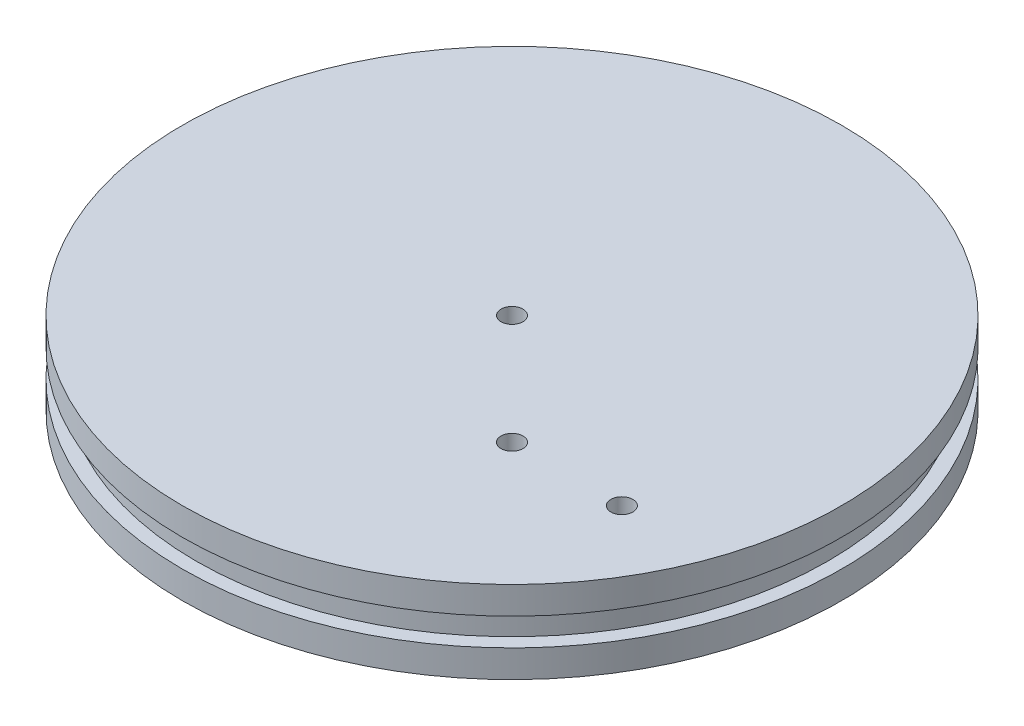
ISO-10303-21;
HEADER;
FILE_DESCRIPTION(('STEP AP214'),'2;1');
FILE_NAME('part.step','',(''),(''),'','','');
FILE_SCHEMA(('AUTOMOTIVE_DESIGN { 1 0 10303 214 1 1 1 1 }'));
ENDSEC;
DATA;
#1=APPLICATION_CONTEXT('core data for automotive mechanical design processes');
#2=APPLICATION_PROTOCOL_DEFINITION('international standard','automotive_design',2000,#1);
#3=PRODUCT_CONTEXT('',#1,'mechanical');
#4=PRODUCT('Part','Part','',(#3));
#5=PRODUCT_RELATED_PRODUCT_CATEGORY('part','',(#4));
#6=PRODUCT_DEFINITION_FORMATION('','',#4);
#7=PRODUCT_DEFINITION_CONTEXT('part definition',#1,'design');
#8=PRODUCT_DEFINITION('design','',#6,#7);
#9=PRODUCT_DEFINITION_SHAPE('','',#8);
#10=(LENGTH_UNIT() NAMED_UNIT(*) SI_UNIT(.MILLI.,.METRE.));
#11=(NAMED_UNIT(*) PLANE_ANGLE_UNIT() SI_UNIT($,.RADIAN.));
#12=(NAMED_UNIT(*) SI_UNIT($,.STERADIAN.) SOLID_ANGLE_UNIT());
#13=UNCERTAINTY_MEASURE_WITH_UNIT(LENGTH_MEASURE(1.E-05),#10,'distance_accuracy_value','');
#14=(GEOMETRIC_REPRESENTATION_CONTEXT(3) GLOBAL_UNCERTAINTY_ASSIGNED_CONTEXT((#13)) GLOBAL_UNIT_ASSIGNED_CONTEXT((#10,
#11,#12)) REPRESENTATION_CONTEXT('',''));
#15=CARTESIAN_POINT('',(0.,0.,0.));
#16=DIRECTION('',(0.,0.,1.));
#17=DIRECTION('',(1.,0.,0.));
#18=AXIS2_PLACEMENT_3D('',#15,#16,#17);
#19=CARTESIAN_POINT('',(0.,19.05,0.));
#20=DIRECTION('',(0.,-1.,0.));
#21=DIRECTION('',(0.,0.,-1.));
#22=AXIS2_PLACEMENT_3D('',#19,#20,#21);
#23=CYLINDRICAL_SURFACE('',#22,76.2);
#24=CARTESIAN_POINT('',(0.,0.,0.));
#25=DIRECTION('',(0.,1.,0.));
#26=DIRECTION('',(0.,0.,1.));
#27=AXIS2_PLACEMENT_3D('',#24,#25,#26);
#28=CIRCLE('',#27,76.2);
#29=CARTESIAN_POINT('',(0.,0.,76.2));
#30=VERTEX_POINT('',#29);
#31=EDGE_CURVE('E35',#30,#30,#28,.T.);
#32=ORIENTED_EDGE('',*,*,#31,.T.);
#33=EDGE_LOOP('',(#32));
#34=FACE_BOUND('',#33,.T.);
#35=CARTESIAN_POINT('',(0.,6.35,0.));
#36=DIRECTION('',(0.,-1.,0.));
#37=DIRECTION('',(0.,0.,-1.));
#38=AXIS2_PLACEMENT_3D('',#35,#36,#37);
#39=CIRCLE('',#38,76.2);
#40=CARTESIAN_POINT('',(0.,6.35,-76.2));
#41=VERTEX_POINT('',#40);
#42=EDGE_CURVE('E59',#41,#41,#39,.T.);
#43=ORIENTED_EDGE('',*,*,#42,.T.);
#44=EDGE_LOOP('',(#43));
#45=FACE_BOUND('',#44,.T.);
#46=ADVANCED_FACE('F32',(#34,#45),#23,.T.);
#47=CARTESIAN_POINT('',(0.,19.05,0.));
#48=DIRECTION('',(0.,1.,0.));
#49=DIRECTION('',(0.,0.,1.));
#50=AXIS2_PLACEMENT_3D('',#47,#48,#49);
#51=CIRCLE('',#50,76.2);
#52=CARTESIAN_POINT('',(0.,19.05,76.2));
#53=VERTEX_POINT('',#52);
#54=EDGE_CURVE('E10',#53,#53,#51,.T.);
#55=ORIENTED_EDGE('',*,*,#54,.F.);
#56=EDGE_LOOP('',(#55));
#57=FACE_BOUND('',#56,.T.);
#58=CARTESIAN_POINT('',(0.,12.7,0.));
#59=DIRECTION('',(0.,-1.,0.));
#60=DIRECTION('',(0.,0.,-1.));
#61=AXIS2_PLACEMENT_3D('',#58,#59,#60);
#62=CIRCLE('',#61,76.2);
#63=CARTESIAN_POINT('',(0.,12.7,-76.2));
#64=VERTEX_POINT('',#63);
#65=EDGE_CURVE('E70',#64,#64,#62,.T.);
#66=ORIENTED_EDGE('',*,*,#65,.F.);
#67=EDGE_LOOP('',(#66));
#68=FACE_BOUND('',#67,.T.);
#69=ADVANCED_FACE('F77',(#57,#68),#23,.T.);
#70=CARTESIAN_POINT('',(0.,19.05,0.));
#71=DIRECTION('',(0.,1.,0.));
#72=DIRECTION('',(0.,0.,1.));
#73=AXIS2_PLACEMENT_3D('',#70,#71,#72);
#74=PLANE('',#73);
#75=CARTESIAN_POINT('',(25.4,19.05,25.4));
#76=DIRECTION('',(0.,1.,0.));
#77=DIRECTION('',(0.,0.,1.));
#78=AXIS2_PLACEMENT_3D('',#75,#76,#77);
#79=CIRCLE('',#78,2.54);
#80=CARTESIAN_POINT('',(25.4,19.05,27.94));
#81=VERTEX_POINT('',#80);
#82=EDGE_CURVE('E47',#81,#81,#79,.T.);
#83=ORIENTED_EDGE('',*,*,#82,.F.);
#84=EDGE_LOOP('',(#83));
#85=FACE_BOUND('',#84,.T.);
#86=ORIENTED_EDGE('',*,*,#54,.T.);
#87=EDGE_LOOP('',(#86));
#88=FACE_BOUND('',#87,.T.);
#89=CARTESIAN_POINT('',(0.,19.05,0.));
#90=DIRECTION('',(0.,1.,0.));
#91=DIRECTION('',(0.,0.,1.));
#92=AXIS2_PLACEMENT_3D('',#89,#90,#91);
#93=CIRCLE('',#92,2.54);
#94=CARTESIAN_POINT('',(0.,19.05,2.54));
#95=VERTEX_POINT('',#94);
#96=EDGE_CURVE('E42',#95,#95,#93,.T.);
#97=ORIENTED_EDGE('',*,*,#96,.F.);
#98=EDGE_LOOP('',(#97));
#99=FACE_BOUND('',#98,.T.);
#100=CARTESIAN_POINT('',(50.8,19.05,25.4));
#101=DIRECTION('',(0.,1.,0.));
#102=DIRECTION('',(0.,0.,1.));
#103=AXIS2_PLACEMENT_3D('',#100,#101,#102);
#104=CIRCLE('',#103,2.54);
#105=CARTESIAN_POINT('',(50.8,19.05,27.94));
#106=VERTEX_POINT('',#105);
#107=EDGE_CURVE('E53',#106,#106,#104,.T.);
#108=ORIENTED_EDGE('',*,*,#107,.F.);
#109=EDGE_LOOP('',(#108));
#110=FACE_BOUND('',#109,.T.);
#111=ADVANCED_FACE('F79',(#85,#88,#99,#110),#74,.T.);
#112=CARTESIAN_POINT('',(0.,0.,0.));
#113=DIRECTION('',(0.,1.,0.));
#114=DIRECTION('',(0.,0.,1.));
#115=AXIS2_PLACEMENT_3D('',#112,#113,#114);
#116=PLANE('',#115);
#117=ORIENTED_EDGE('',*,*,#31,.F.);
#118=EDGE_LOOP('',(#117));
#119=FACE_BOUND('',#118,.T.);
#120=CARTESIAN_POINT('',(0.,0.,0.));
#121=DIRECTION('',(0.,1.,0.));
#122=DIRECTION('',(0.,0.,1.));
#123=AXIS2_PLACEMENT_3D('',#120,#121,#122);
#124=CIRCLE('',#123,2.54);
#125=CARTESIAN_POINT('',(0.,0.,2.54));
#126=VERTEX_POINT('',#125);
#127=EDGE_CURVE('E44',#126,#126,#124,.T.);
#128=ORIENTED_EDGE('',*,*,#127,.T.);
#129=EDGE_LOOP('',(#128));
#130=FACE_BOUND('',#129,.T.);
#131=CARTESIAN_POINT('',(25.4,0.,25.4));
#132=DIRECTION('',(0.,1.,0.));
#133=DIRECTION('',(0.,0.,1.));
#134=AXIS2_PLACEMENT_3D('',#131,#132,#133);
#135=CIRCLE('',#134,2.54);
#136=CARTESIAN_POINT('',(25.4,0.,27.94));
#137=VERTEX_POINT('',#136);
#138=EDGE_CURVE('E50',#137,#137,#135,.T.);
#139=ORIENTED_EDGE('',*,*,#138,.T.);
#140=EDGE_LOOP('',(#139));
#141=FACE_BOUND('',#140,.T.);
#142=CARTESIAN_POINT('',(50.8,0.,25.4));
#143=DIRECTION('',(0.,1.,0.));
#144=DIRECTION('',(0.,0.,1.));
#145=AXIS2_PLACEMENT_3D('',#142,#143,#144);
#146=CIRCLE('',#145,2.54);
#147=CARTESIAN_POINT('',(50.8,0.,27.94));
#148=VERTEX_POINT('',#147);
#149=EDGE_CURVE('E56',#148,#148,#146,.T.);
#150=ORIENTED_EDGE('',*,*,#149,.T.);
#151=EDGE_LOOP('',(#150));
#152=FACE_BOUND('',#151,.T.);
#153=ADVANCED_FACE('F85',(#119,#130,#141,#152),#116,.F.);
#154=CARTESIAN_POINT('',(0.,19.05,0.));
#155=DIRECTION('',(0.,-1.,0.));
#156=DIRECTION('',(0.,0.,-1.));
#157=AXIS2_PLACEMENT_3D('',#154,#155,#156);
#158=CYLINDRICAL_SURFACE('',#157,2.54);
#159=ORIENTED_EDGE('',*,*,#96,.T.);
#160=EDGE_LOOP('',(#159));
#161=FACE_BOUND('',#160,.T.);
#162=ORIENTED_EDGE('',*,*,#127,.F.);
#163=EDGE_LOOP('',(#162));
#164=FACE_BOUND('',#163,.T.);
#165=ADVANCED_FACE('F114',(#161,#164),#158,.F.);
#166=CARTESIAN_POINT('',(25.4,19.05,25.4));
#167=DIRECTION('',(0.,-1.,0.));
#168=DIRECTION('',(0.,0.,-1.));
#169=AXIS2_PLACEMENT_3D('',#166,#167,#168);
#170=CYLINDRICAL_SURFACE('',#169,2.54);
#171=ORIENTED_EDGE('',*,*,#82,.T.);
#172=EDGE_LOOP('',(#171));
#173=FACE_BOUND('',#172,.T.);
#174=ORIENTED_EDGE('',*,*,#138,.F.);
#175=EDGE_LOOP('',(#174));
#176=FACE_BOUND('',#175,.T.);
#177=ADVANCED_FACE('F107',(#173,#176),#170,.F.);
#178=CARTESIAN_POINT('',(50.8,19.05,25.4));
#179=DIRECTION('',(0.,-1.,0.));
#180=DIRECTION('',(0.,0.,-1.));
#181=AXIS2_PLACEMENT_3D('',#178,#179,#180);
#182=CYLINDRICAL_SURFACE('',#181,2.54);
#183=ORIENTED_EDGE('',*,*,#107,.T.);
#184=EDGE_LOOP('',(#183));
#185=FACE_BOUND('',#184,.T.);
#186=ORIENTED_EDGE('',*,*,#149,.F.);
#187=EDGE_LOOP('',(#186));
#188=FACE_BOUND('',#187,.T.);
#189=ADVANCED_FACE('F98',(#185,#188),#182,.F.);
#190=CARTESIAN_POINT('',(-76.2,6.35,0.));
#191=DIRECTION('',(0.,1.,0.));
#192=DIRECTION('',(0.,0.,1.));
#193=AXIS2_PLACEMENT_3D('',#190,#191,#192);
#194=PLANE('',#193);
#195=CARTESIAN_POINT('',(0.,6.35,0.));
#196=DIRECTION('',(0.,-1.,0.));
#197=DIRECTION('',(0.,0.,-1.));
#198=AXIS2_PLACEMENT_3D('',#195,#196,#197);
#199=CIRCLE('',#198,73.025);
#200=CARTESIAN_POINT('',(0.,6.35,-73.025));
#201=VERTEX_POINT('',#200);
#202=EDGE_CURVE('E64',#201,#201,#199,.T.);
#203=ORIENTED_EDGE('',*,*,#202,.T.);
#204=EDGE_LOOP('',(#203));
#205=FACE_BOUND('',#204,.T.);
#206=ORIENTED_EDGE('',*,*,#42,.F.);
#207=EDGE_LOOP('',(#206));
#208=FACE_BOUND('',#207,.T.);
#209=ADVANCED_FACE('F95',(#205,#208),#194,.T.);
#210=CARTESIAN_POINT('',(0.,4.7625,0.));
#211=DIRECTION('',(0.,-1.,0.));
#212=DIRECTION('',(0.,0.,-1.));
#213=AXIS2_PLACEMENT_3D('',#210,#211,#212);
#214=CYLINDRICAL_SURFACE('',#213,73.025);
#215=CARTESIAN_POINT('',(0.,12.7,0.));
#216=DIRECTION('',(0.,-1.,0.));
#217=DIRECTION('',(0.,0.,-1.));
#218=AXIS2_PLACEMENT_3D('',#215,#216,#217);
#219=CIRCLE('',#218,73.025);
#220=CARTESIAN_POINT('',(0.,12.7,-73.025));
#221=VERTEX_POINT('',#220);
#222=EDGE_CURVE('E67',#221,#221,#219,.T.);
#223=ORIENTED_EDGE('',*,*,#222,.T.);
#224=EDGE_LOOP('',(#223));
#225=FACE_BOUND('',#224,.T.);
#226=ORIENTED_EDGE('',*,*,#202,.F.);
#227=EDGE_LOOP('',(#226));
#228=FACE_BOUND('',#227,.T.);
#229=ADVANCED_FACE('F97',(#225,#228),#214,.T.);
#230=CARTESIAN_POINT('',(-76.2,12.7,0.));
#231=DIRECTION('',(0.,-1.,0.));
#232=DIRECTION('',(0.,0.,-1.));
#233=AXIS2_PLACEMENT_3D('',#230,#231,#232);
#234=PLANE('',#233);
#235=ORIENTED_EDGE('',*,*,#65,.T.);
#236=EDGE_LOOP('',(#235));
#237=FACE_BOUND('',#236,.T.);
#238=ORIENTED_EDGE('',*,*,#222,.F.);
#239=EDGE_LOOP('',(#238));
#240=FACE_BOUND('',#239,.T.);
#241=ADVANCED_FACE('F74',(#237,#240),#234,.T.);
#242=CLOSED_SHELL('',(#46,#69,#111,#153,#165,#177,#189,#209,#229,#241));
#243=MANIFOLD_SOLID_BREP('B2',#242);
#244=ADVANCED_BREP_SHAPE_REPRESENTATION('',(#18,#243),#14);
#245=SHAPE_DEFINITION_REPRESENTATION(#9,#244);
ENDSEC;
END-ISO-10303-21;
